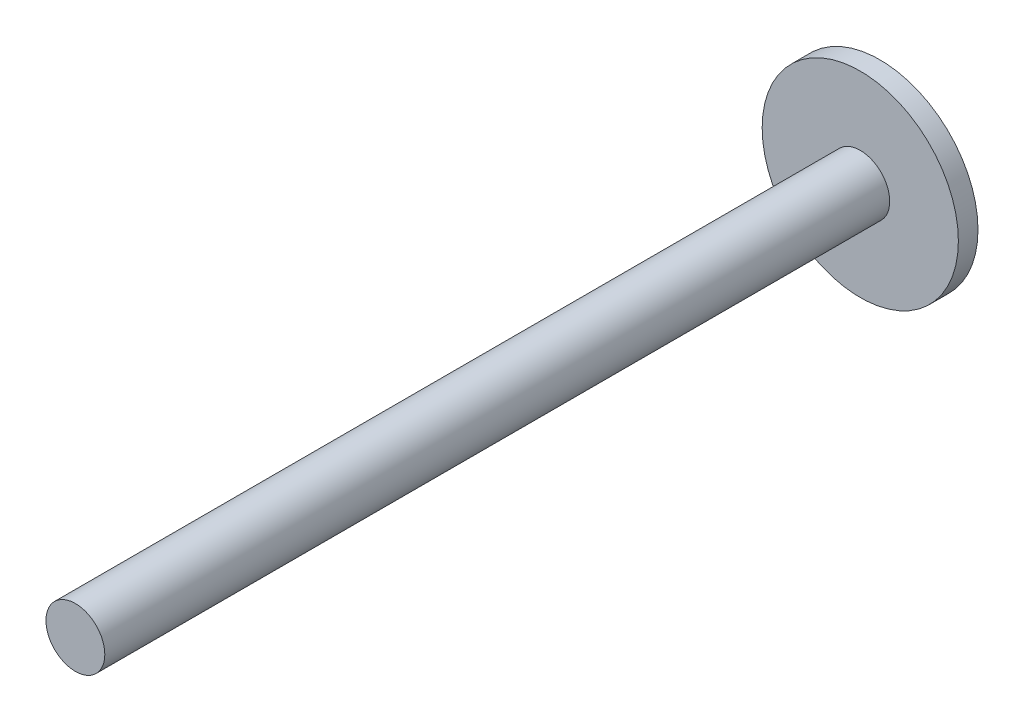
ISO-10303-21;
HEADER;
FILE_DESCRIPTION(('STEP AP214'),'2;1');
FILE_NAME('part.step','',(''),(''),'','','');
FILE_SCHEMA(('AUTOMOTIVE_DESIGN { 1 0 10303 214 1 1 1 1 }'));
ENDSEC;
DATA;
#1=APPLICATION_CONTEXT('core data for automotive mechanical design processes');
#2=APPLICATION_PROTOCOL_DEFINITION('international standard','automotive_design',2000,#1);
#3=PRODUCT_CONTEXT('',#1,'mechanical');
#4=PRODUCT('Part','Part','',(#3));
#5=PRODUCT_RELATED_PRODUCT_CATEGORY('part','',(#4));
#6=PRODUCT_DEFINITION_FORMATION('','',#4);
#7=PRODUCT_DEFINITION_CONTEXT('part definition',#1,'design');
#8=PRODUCT_DEFINITION('design','',#6,#7);
#9=PRODUCT_DEFINITION_SHAPE('','',#8);
#10=(LENGTH_UNIT() NAMED_UNIT(*) SI_UNIT(.MILLI.,.METRE.));
#11=(NAMED_UNIT(*) PLANE_ANGLE_UNIT() SI_UNIT($,.RADIAN.));
#12=(NAMED_UNIT(*) SI_UNIT($,.STERADIAN.) SOLID_ANGLE_UNIT());
#13=UNCERTAINTY_MEASURE_WITH_UNIT(LENGTH_MEASURE(1.E-05),#10,'distance_accuracy_value','');
#14=(GEOMETRIC_REPRESENTATION_CONTEXT(3) GLOBAL_UNCERTAINTY_ASSIGNED_CONTEXT((#13)) GLOBAL_UNIT_ASSIGNED_CONTEXT((#10,
#11,#12)) REPRESENTATION_CONTEXT('',''));
#15=CARTESIAN_POINT('',(0.,0.,0.));
#16=DIRECTION('',(0.,0.,1.));
#17=DIRECTION('',(1.,0.,0.));
#18=AXIS2_PLACEMENT_3D('',#15,#16,#17);
#19=CARTESIAN_POINT('',(0.,0.,12000.));
#20=DIRECTION('',(0.,0.,-1.));
#21=DIRECTION('',(-1.,0.,0.));
#22=AXIS2_PLACEMENT_3D('',#19,#20,#21);
#23=CYLINDRICAL_SURFACE('',#22,450.);
#24=CARTESIAN_POINT('',(0.,0.,12000.));
#25=DIRECTION('',(0.,0.,1.));
#26=DIRECTION('',(1.,0.,0.));
#27=AXIS2_PLACEMENT_3D('',#24,#25,#26);
#28=CIRCLE('',#27,450.);
#29=CARTESIAN_POINT('',(450.,0.,12000.));
#30=VERTEX_POINT('',#29);
#31=EDGE_CURVE('E10',#30,#30,#28,.T.);
#32=ORIENTED_EDGE('',*,*,#31,.F.);
#33=EDGE_LOOP('',(#32));
#34=FACE_BOUND('',#33,.T.);
#35=CARTESIAN_POINT('',(0.,0.,0.));
#36=DIRECTION('',(0.,0.,1.));
#37=DIRECTION('',(1.,0.,0.));
#38=AXIS2_PLACEMENT_3D('',#35,#36,#37);
#39=CIRCLE('',#38,450.);
#40=CARTESIAN_POINT('',(450.,0.,0.));
#41=VERTEX_POINT('',#40);
#42=EDGE_CURVE('E44',#41,#41,#39,.T.);
#43=ORIENTED_EDGE('',*,*,#42,.T.);
#44=EDGE_LOOP('',(#43));
#45=FACE_BOUND('',#44,.T.);
#46=ADVANCED_FACE('F41',(#34,#45),#23,.T.);
#47=CARTESIAN_POINT('',(0.,0.,12000.));
#48=DIRECTION('',(0.,0.,1.));
#49=DIRECTION('',(1.,0.,0.));
#50=AXIS2_PLACEMENT_3D('',#47,#48,#49);
#51=PLANE('',#50);
#52=ORIENTED_EDGE('',*,*,#31,.T.);
#53=EDGE_LOOP('',(#52));
#54=FACE_BOUND('',#53,.T.);
#55=ADVANCED_FACE('F68',(#54),#51,.T.);
#56=CARTESIAN_POINT('',(0.,0.,-300.));
#57=DIRECTION('',(0.,0.,1.));
#58=DIRECTION('',(1.,0.,0.));
#59=AXIS2_PLACEMENT_3D('',#56,#57,#58);
#60=CYLINDRICAL_SURFACE('',#59,1500.);
#61=CARTESIAN_POINT('',(0.,0.,-300.));
#62=DIRECTION('',(0.,0.,-1.));
#63=DIRECTION('',(-1.,0.,0.));
#64=AXIS2_PLACEMENT_3D('',#61,#62,#63);
#65=CIRCLE('',#64,1500.);
#66=CARTESIAN_POINT('',(-1500.,0.,-300.));
#67=VERTEX_POINT('',#66);
#68=EDGE_CURVE('E53',#67,#67,#65,.T.);
#69=ORIENTED_EDGE('',*,*,#68,.F.);
#70=EDGE_LOOP('',(#69));
#71=FACE_BOUND('',#70,.T.);
#72=CARTESIAN_POINT('',(0.,0.,0.));
#73=DIRECTION('',(0.,0.,-1.));
#74=DIRECTION('',(-1.,0.,0.));
#75=AXIS2_PLACEMENT_3D('',#72,#73,#74);
#76=CIRCLE('',#75,1500.);
#77=CARTESIAN_POINT('',(-1500.,0.,0.));
#78=VERTEX_POINT('',#77);
#79=EDGE_CURVE('E55',#78,#78,#76,.T.);
#80=ORIENTED_EDGE('',*,*,#79,.T.);
#81=EDGE_LOOP('',(#80));
#82=FACE_BOUND('',#81,.T.);
#83=ADVANCED_FACE('F65',(#71,#82),#60,.T.);
#84=CARTESIAN_POINT('',(0.,0.,-300.));
#85=DIRECTION('',(0.,0.,-1.));
#86=DIRECTION('',(-1.,0.,0.));
#87=AXIS2_PLACEMENT_3D('',#84,#85,#86);
#88=PLANE('',#87);
#89=ORIENTED_EDGE('',*,*,#68,.T.);
#90=EDGE_LOOP('',(#89));
#91=FACE_BOUND('',#90,.T.);
#92=ADVANCED_FACE('F63',(#91),#88,.T.);
#93=CARTESIAN_POINT('',(0.,0.,0.));
#94=DIRECTION('',(0.,0.,-1.));
#95=DIRECTION('',(-1.,0.,0.));
#96=AXIS2_PLACEMENT_3D('',#93,#94,#95);
#97=PLANE('',#96);
#98=ORIENTED_EDGE('',*,*,#42,.F.);
#99=EDGE_LOOP('',(#98));
#100=FACE_BOUND('',#99,.T.);
#101=ORIENTED_EDGE('',*,*,#79,.F.);
#102=EDGE_LOOP('',(#101));
#103=FACE_BOUND('',#102,.T.);
#104=ADVANCED_FACE('F72',(#100,#103),#97,.F.);
#105=CLOSED_SHELL('',(#46,#55,#83,#92,#104));
#106=MANIFOLD_SOLID_BREP('B2',#105);
#107=ADVANCED_BREP_SHAPE_REPRESENTATION('',(#18,#106),#14);
#108=SHAPE_DEFINITION_REPRESENTATION(#9,#107);
ENDSEC;
END-ISO-10303-21;
